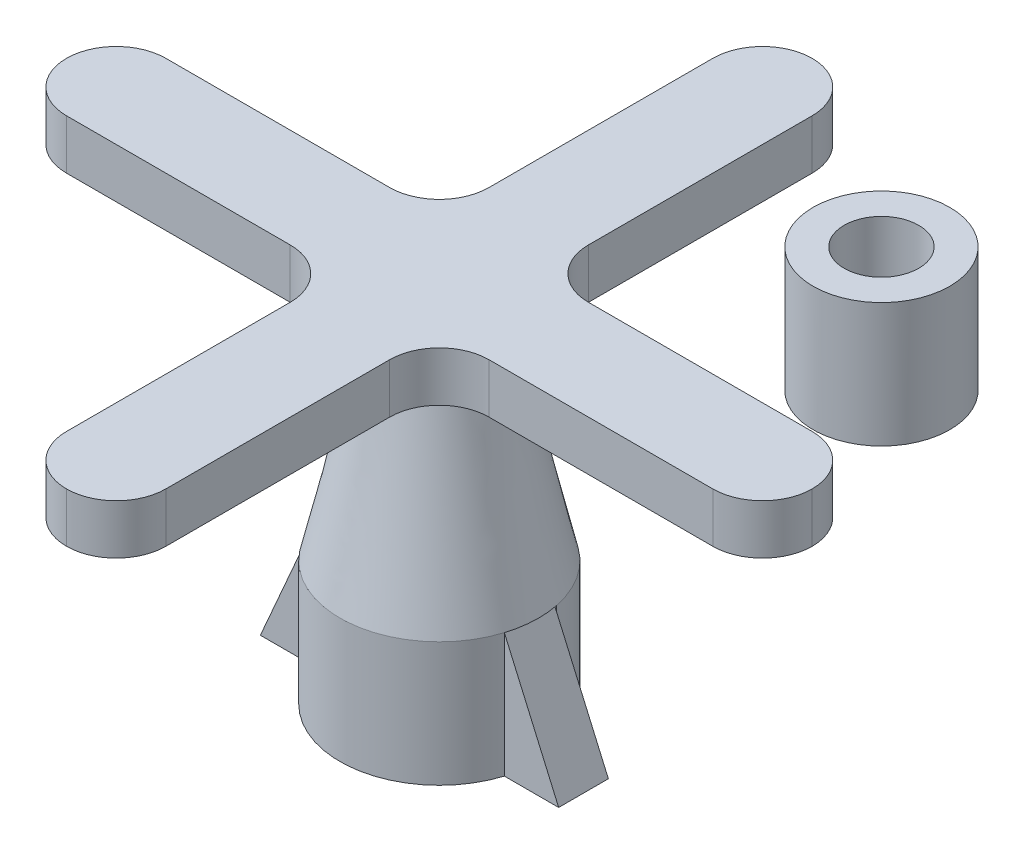
ISO-10303-21;
HEADER;
FILE_DESCRIPTION(('STEP AP214'),'2;1');
FILE_NAME('part.step','',(''),(''),'','','');
FILE_SCHEMA(('AUTOMOTIVE_DESIGN { 1 0 10303 214 1 1 1 1 }'));
ENDSEC;
DATA;
#1=APPLICATION_CONTEXT('core data for automotive mechanical design processes');
#2=APPLICATION_PROTOCOL_DEFINITION('international standard','automotive_design',2000,#1);
#3=PRODUCT_CONTEXT('',#1,'mechanical');
#4=PRODUCT('Part','Part','',(#3));
#5=PRODUCT_RELATED_PRODUCT_CATEGORY('part','',(#4));
#6=PRODUCT_DEFINITION_FORMATION('','',#4);
#7=PRODUCT_DEFINITION_CONTEXT('part definition',#1,'design');
#8=PRODUCT_DEFINITION('design','',#6,#7);
#9=PRODUCT_DEFINITION_SHAPE('','',#8);
#10=(LENGTH_UNIT() NAMED_UNIT(*) SI_UNIT(.MILLI.,.METRE.));
#11=(NAMED_UNIT(*) PLANE_ANGLE_UNIT() SI_UNIT($,.RADIAN.));
#12=(NAMED_UNIT(*) SI_UNIT($,.STERADIAN.) SOLID_ANGLE_UNIT());
#13=UNCERTAINTY_MEASURE_WITH_UNIT(LENGTH_MEASURE(1.E-05),#10,'distance_accuracy_value','');
#14=(GEOMETRIC_REPRESENTATION_CONTEXT(3) GLOBAL_UNCERTAINTY_ASSIGNED_CONTEXT((#13)) GLOBAL_UNIT_ASSIGNED_CONTEXT((#10,
#11,#12)) REPRESENTATION_CONTEXT('',''));
#15=CARTESIAN_POINT('',(0.,0.,0.));
#16=DIRECTION('',(0.,0.,1.));
#17=DIRECTION('',(1.,0.,0.));
#18=AXIS2_PLACEMENT_3D('',#15,#16,#17);
#19=CARTESIAN_POINT('',(3.5279812011762,0.,1.88503279657075));
#20=CARTESIAN_POINT('',(1.98531269592162,10.,-0.241936974049907));
#21=CARTESIAN_POINT('',(7.2980467943177,0.,-5.17092960578165));
#22=CARTESIAN_POINT('',(1.50143874782181,10.,-4.21256236589315));
#23=CARTESIAN_POINT('',(0.242084391965302,0.,-8.94099519892315));
#24=CARTESIAN_POINT('',(-2.46918664402143,10.,-3.72868841779334));
#25=CARTESIAN_POINT('',(-3.5279812011762,0.,-1.88503279657075));
#26=CARTESIAN_POINT('',(-1.98531269592162,10.,0.241936974049907));
#27=CARTESIAN_POINT('',(-7.2980467943177,0.,5.17092960578165));
#28=CARTESIAN_POINT('',(-1.50143874782181,10.,4.21256236589315));
#29=CARTESIAN_POINT('',(-0.242084391965299,0.,8.94099519892315));
#30=CARTESIAN_POINT('',(2.46918664402143,10.,3.72868841779333));
#31=CARTESIAN_POINT('',(3.5279812011762,0.,1.88503279657075));
#32=CARTESIAN_POINT('',(1.98531269592162,10.,-0.241936974049907));
#33=(BOUNDED_SURFACE() B_SPLINE_SURFACE(3,1,((#19,#20),(#21,#22),(#23,#24),(#25,#26),(#27,#28),
(#29,#30),(#31,#32)),.UNSPECIFIED.,.T.,.F.,.F.) B_SPLINE_SURFACE_WITH_KNOTS((4,3,4),(2,2),(0.,
0.5,1.),(0.,1.),.UNSPECIFIED.) GEOMETRIC_REPRESENTATION_ITEM() RATIONAL_B_SPLINE_SURFACE(((1.,
1.),(0.333333333333333,0.333333333333333),(0.333333333333333,0.333333333333333),(1.,1.),
(0.333333333333333,0.333333333333333),(0.333333333333333,0.333333333333333),(1.,1.))) REPRESENTATION_ITEM('') SURFACE());
#34=CARTESIAN_POINT('',(0.,0.,0.));
#35=DIRECTION('',(0.,-1.,0.));
#36=DIRECTION('',(0.,0.,-1.));
#37=AXIS2_PLACEMENT_3D('',#34,#35,#36);
#38=CIRCLE('',#37,4.);
#39=CARTESIAN_POINT('',(3.91905509174876,0.,-0.800629244930588));
#40=VERTEX_POINT('',#39);
#41=CARTESIAN_POINT('',(3.81595463703176,0.,1.19937075506941));
#42=VERTEX_POINT('',#41);
#43=EDGE_CURVE('E306',#40,#42,#38,.T.);
#44=CARTESIAN_POINT('',(-3.91905509174876,0.,-0.800629244930588));
#45=VERTEX_POINT('',#44);
#46=EDGE_CURVE('E284',#45,#40,#38,.T.);
#47=CARTESIAN_POINT('',(0.,0.,0.));
#48=DIRECTION('',(0.,1.,0.));
#49=DIRECTION('',(0.,0.,1.));
#50=AXIS2_PLACEMENT_3D('',#47,#48,#49);
#51=CIRCLE('',#50,4.);
#52=CARTESIAN_POINT('',(-3.81595463703176,0.,1.19937075506941));
#53=VERTEX_POINT('',#52);
#54=EDGE_CURVE('E341',#45,#53,#51,.T.);
#55=EDGE_CURVE('E310',#42,#53,#38,.T.);
#56=CARTESIAN_POINT('',(0.,8.,0.));
#57=DIRECTION('',(0.,1.,0.));
#58=DIRECTION('',(0.,0.,1.));
#59=AXIS2_PLACEMENT_3D('',#56,#57,#58);
#60=CIRCLE('',#59,2.30117095332829);
#61=CARTESIAN_POINT('',(0.,8.,2.30117095332829));
#62=VERTEX_POINT('',#61);
#63=EDGE_CURVE('E343',#62,#62,#60,.F.);
#64=ORIENTED_EDGE('',*,*,#43,.F.);
#65=ORIENTED_EDGE('',*,*,#46,.F.);
#66=ORIENTED_EDGE('',*,*,#54,.T.);
#67=ORIENTED_EDGE('',*,*,#55,.F.);
#68=EDGE_LOOP('',(#64,#65,#66,#67));
#69=FACE_BOUND('',#68,.T.);
#70=ORIENTED_EDGE('',*,*,#63,.T.);
#71=EDGE_LOOP('',(#70));
#72=FACE_BOUND('',#71,.T.);
#73=ADVANCED_FACE('F76',(#69,#72),#33,.T.);
#74=CARTESIAN_POINT('',(-2.55,0.,1.19937075506941));
#75=DIRECTION('',(0.,0.,1.));
#76=DIRECTION('',(1.,0.,0.));
#77=AXIS2_PLACEMENT_3D('',#74,#75,#76);
#78=PLANE('',#77);
#79=DIRECTION('',(0.,1.,0.));
#80=VECTOR('',#79,1.);
#81=CARTESIAN_POINT('',(-3.81595463703176,-5.,1.19937075506941));
#82=LINE('',#81,#80);
#83=CARTESIAN_POINT('',(-3.81595463703176,-5.,1.19937075506941));
#84=VERTEX_POINT('',#83);
#85=EDGE_CURVE('E313',#53,#84,#82,.F.);
#86=ORIENTED_EDGE('',*,*,#85,.F.);
#87=DIRECTION('',(0.400287328422539,0.916389684961778,0.));
#88=VECTOR('',#87,1.);
#89=CARTESIAN_POINT('',(-6.,-5.,1.19937075506941));
#90=LINE('',#89,#88);
#91=CARTESIAN_POINT('',(-6.,-5.,1.19937075506941));
#92=VERTEX_POINT('',#91);
#93=EDGE_CURVE('E322',#92,#53,#90,.T.);
#94=ORIENTED_EDGE('',*,*,#93,.F.);
#95=DIRECTION('',(-1.,0.,0.));
#96=VECTOR('',#95,1.);
#97=CARTESIAN_POINT('',(-2.55,-5.,1.19937075506941));
#98=LINE('',#97,#96);
#99=EDGE_CURVE('E418',#84,#92,#98,.T.);
#100=ORIENTED_EDGE('',*,*,#99,.F.);
#101=EDGE_LOOP('',(#86,#94,#100));
#102=FACE_BOUND('',#101,.T.);
#103=ADVANCED_FACE('F521',(#102),#78,.T.);
#104=CARTESIAN_POINT('',(2.55,0.,1.19937075506941));
#105=DIRECTION('',(0.,0.,1.));
#106=DIRECTION('',(1.,0.,0.));
#107=AXIS2_PLACEMENT_3D('',#104,#105,#106);
#108=PLANE('',#107);
#109=DIRECTION('',(-1.,0.,0.));
#110=VECTOR('',#109,1.);
#111=CARTESIAN_POINT('',(2.55,-5.,1.19937075506941));
#112=LINE('',#111,#110);
#113=CARTESIAN_POINT('',(6.,-5.,1.19937075506941));
#114=VERTEX_POINT('',#113);
#115=CARTESIAN_POINT('',(3.81595463703177,-5.,1.19937075506941));
#116=VERTEX_POINT('',#115);
#117=EDGE_CURVE('E314',#114,#116,#112,.T.);
#118=ORIENTED_EDGE('',*,*,#117,.F.);
#119=DIRECTION('',(0.400287328422539,-0.916389684961778,0.));
#120=VECTOR('',#119,1.);
#121=CARTESIAN_POINT('',(3.81595463703176,0.,1.19937075506941));
#122=LINE('',#121,#120);
#123=EDGE_CURVE('E323',#42,#114,#122,.T.);
#124=ORIENTED_EDGE('',*,*,#123,.F.);
#125=DIRECTION('',(0.,1.,0.));
#126=VECTOR('',#125,1.);
#127=CARTESIAN_POINT('',(3.81595463703176,-5.,1.19937075506941));
#128=LINE('',#127,#126);
#129=EDGE_CURVE('E354',#116,#42,#128,.T.);
#130=ORIENTED_EDGE('',*,*,#129,.F.);
#131=EDGE_LOOP('',(#118,#124,#130));
#132=FACE_BOUND('',#131,.T.);
#133=ADVANCED_FACE('F397',(#132),#108,.T.);
#134=CARTESIAN_POINT('',(0.,-5.,0.));
#135=DIRECTION('',(0.,1.,0.));
#136=DIRECTION('',(0.,0.,1.));
#137=AXIS2_PLACEMENT_3D('',#134,#135,#136);
#138=CYLINDRICAL_SURFACE('',#137,4.);
#139=CARTESIAN_POINT('',(0.,-5.,0.));
#140=DIRECTION('',(0.,-1.,0.));
#141=DIRECTION('',(0.,0.,-1.));
#142=AXIS2_PLACEMENT_3D('',#139,#140,#141);
#143=CIRCLE('',#142,4.);
#144=CARTESIAN_POINT('',(-3.91905509174876,-5.,-0.800629244930589));
#145=VERTEX_POINT('',#144);
#146=CARTESIAN_POINT('',(3.91905509174876,-5.,-0.800629244930588));
#147=VERTEX_POINT('',#146);
#148=EDGE_CURVE('E419',#145,#147,#143,.T.);
#149=ORIENTED_EDGE('',*,*,#148,.F.);
#150=DIRECTION('',(0.,1.,0.));
#151=VECTOR('',#150,1.);
#152=CARTESIAN_POINT('',(-3.91905509174876,-5.,-0.800629244930588));
#153=LINE('',#152,#151);
#154=CARTESIAN_POINT('',(-3.91905509174876,-0.236030937051775,-0.800629244930588));
#155=VERTEX_POINT('',#154);
#156=EDGE_CURVE('E346',#145,#155,#153,.T.);
#157=ORIENTED_EDGE('',*,*,#156,.T.);
#158=EDGE_CURVE('E289',#155,#45,#153,.T.);
#159=ORIENTED_EDGE('',*,*,#158,.T.);
#160=ORIENTED_EDGE('',*,*,#46,.T.);
#161=DIRECTION('',(0.,1.,0.));
#162=VECTOR('',#161,1.);
#163=CARTESIAN_POINT('',(3.91905509174876,-5.,-0.800629244930588));
#164=LINE('',#163,#162);
#165=CARTESIAN_POINT('',(3.91905509174876,-0.236030937051775,-0.800629244930588));
#166=VERTEX_POINT('',#165);
#167=EDGE_CURVE('E288',#40,#166,#164,.F.);
#168=ORIENTED_EDGE('',*,*,#167,.T.);
#169=EDGE_CURVE('E315',#166,#147,#164,.F.);
#170=ORIENTED_EDGE('',*,*,#169,.T.);
#171=EDGE_LOOP('',(#149,#157,#159,#160,#168,#170));
#172=FACE_BOUND('',#171,.T.);
#173=ADVANCED_FACE('F364',(#172),#138,.T.);
#174=CARTESIAN_POINT('',(0.,-5.,0.));
#175=DIRECTION('',(0.,-1.,0.));
#176=DIRECTION('',(0.,0.,-1.));
#177=AXIS2_PLACEMENT_3D('',#174,#175,#176);
#178=PLANE('',#177);
#179=CARTESIAN_POINT('',(0.,-5.,0.));
#180=DIRECTION('',(0.,-1.,0.));
#181=DIRECTION('',(0.,0.,-1.));
#182=AXIS2_PLACEMENT_3D('',#179,#180,#181);
#183=CIRCLE('',#182,2.75);
#184=CARTESIAN_POINT('',(0.,-5.,-2.75));
#185=VERTEX_POINT('',#184);
#186=EDGE_CURVE('E334',#185,#185,#183,.T.);
#187=ORIENTED_EDGE('',*,*,#186,.F.);
#188=EDGE_LOOP('',(#187));
#189=FACE_BOUND('',#188,.T.);
#190=EDGE_CURVE('E405',#116,#84,#143,.T.);
#191=ORIENTED_EDGE('',*,*,#190,.T.);
#192=ORIENTED_EDGE('',*,*,#99,.T.);
#193=DIRECTION('',(0.,0.,-1.));
#194=VECTOR('',#193,1.);
#195=CARTESIAN_POINT('',(-6.,-5.,-0.800629244930588));
#196=LINE('',#195,#194);
#197=CARTESIAN_POINT('',(-6.,-5.,-0.800629244930588));
#198=VERTEX_POINT('',#197);
#199=EDGE_CURVE('E423',#92,#198,#196,.T.);
#200=ORIENTED_EDGE('',*,*,#199,.T.);
#201=DIRECTION('',(1.,0.,0.));
#202=VECTOR('',#201,1.);
#203=CARTESIAN_POINT('',(-2.55,-5.,-0.800629244930588));
#204=LINE('',#203,#202);
#205=EDGE_CURVE('E427',#198,#145,#204,.T.);
#206=ORIENTED_EDGE('',*,*,#205,.T.);
#207=ORIENTED_EDGE('',*,*,#148,.T.);
#208=DIRECTION('',(1.,0.,0.));
#209=VECTOR('',#208,1.);
#210=CARTESIAN_POINT('',(2.55,-5.,-0.800629244930588));
#211=LINE('',#210,#209);
#212=CARTESIAN_POINT('',(6.,-5.,-0.800629244930588));
#213=VERTEX_POINT('',#212);
#214=EDGE_CURVE('E426',#147,#213,#211,.T.);
#215=ORIENTED_EDGE('',*,*,#214,.T.);
#216=DIRECTION('',(0.,0.,1.));
#217=VECTOR('',#216,1.);
#218=CARTESIAN_POINT('',(6.,-5.,1.19937075506941));
#219=LINE('',#218,#217);
#220=EDGE_CURVE('E431',#213,#114,#219,.T.);
#221=ORIENTED_EDGE('',*,*,#220,.T.);
#222=ORIENTED_EDGE('',*,*,#117,.T.);
#223=EDGE_LOOP('',(#191,#192,#200,#206,#207,#215,#221,#222));
#224=FACE_BOUND('',#223,.T.);
#225=ADVANCED_FACE('F539',(#189,#224),#178,.T.);
#226=ORIENTED_EDGE('',*,*,#55,.T.);
#227=ORIENTED_EDGE('',*,*,#85,.T.);
#228=ORIENTED_EDGE('',*,*,#190,.F.);
#229=ORIENTED_EDGE('',*,*,#129,.T.);
#230=EDGE_LOOP('',(#226,#227,#228,#229));
#231=FACE_BOUND('',#230,.T.);
#232=ADVANCED_FACE('F402',(#231),#138,.T.);
#233=CARTESIAN_POINT('',(2.55,0.,-0.800629244930588));
#234=DIRECTION('',(0.,0.,-1.));
#235=DIRECTION('',(-1.,0.,0.));
#236=AXIS2_PLACEMENT_3D('',#233,#234,#235);
#237=PLANE('',#236);
#238=DIRECTION('',(0.400287328422539,-0.916389684961778,0.));
#239=VECTOR('',#238,1.);
#240=CARTESIAN_POINT('',(6.,-5.,-0.800629244930588));
#241=LINE('',#240,#239);
#242=EDGE_CURVE('E406',#166,#213,#241,.T.);
#243=ORIENTED_EDGE('',*,*,#242,.T.);
#244=ORIENTED_EDGE('',*,*,#214,.F.);
#245=ORIENTED_EDGE('',*,*,#169,.F.);
#246=EDGE_LOOP('',(#243,#244,#245));
#247=FACE_BOUND('',#246,.T.);
#248=ADVANCED_FACE('F538',(#247),#237,.T.);
#249=CARTESIAN_POINT('',(-2.55,0.,-0.800629244930588));
#250=DIRECTION('',(0.,0.,-1.));
#251=DIRECTION('',(-1.,0.,0.));
#252=AXIS2_PLACEMENT_3D('',#249,#250,#251);
#253=PLANE('',#252);
#254=DIRECTION('',(0.400287328422539,0.916389684961778,0.));
#255=VECTOR('',#254,1.);
#256=CARTESIAN_POINT('',(-3.81595463703176,0.,-0.800629244930588));
#257=LINE('',#256,#255);
#258=EDGE_CURVE('E409',#198,#155,#257,.T.);
#259=ORIENTED_EDGE('',*,*,#258,.T.);
#260=ORIENTED_EDGE('',*,*,#156,.F.);
#261=ORIENTED_EDGE('',*,*,#205,.F.);
#262=EDGE_LOOP('',(#259,#260,#261));
#263=FACE_BOUND('',#262,.T.);
#264=ADVANCED_FACE('F547',(#263),#253,.T.);
#265=CARTESIAN_POINT('',(0.,0.,0.));
#266=DIRECTION('',(0.,-1.,0.));
#267=DIRECTION('',(0.,0.,-1.));
#268=AXIS2_PLACEMENT_3D('',#265,#266,#267);
#269=CYLINDRICAL_SURFACE('',#268,2.75);
#270=CARTESIAN_POINT('',(0.,0.,0.));
#271=DIRECTION('',(0.,1.,0.));
#272=DIRECTION('',(0.,0.,1.));
#273=AXIS2_PLACEMENT_3D('',#270,#271,#272);
#274=CIRCLE('',#273,2.75);
#275=CARTESIAN_POINT('',(0.,0.,2.75));
#276=VERTEX_POINT('',#275);
#277=EDGE_CURVE('E442',#276,#276,#274,.T.);
#278=ORIENTED_EDGE('',*,*,#277,.T.);
#279=EDGE_LOOP('',(#278));
#280=FACE_BOUND('',#279,.T.);
#281=ORIENTED_EDGE('',*,*,#186,.T.);
#282=EDGE_LOOP('',(#281));
#283=FACE_BOUND('',#282,.T.);
#284=ADVANCED_FACE('F458',(#280,#283),#269,.F.);
#285=CARTESIAN_POINT('',(2.75,0.,0.));
#286=CARTESIAN_POINT('',(2.61984920581438,1.77145222827966,0.));
#287=CARTESIAN_POINT('',(0.,1.6,0.));
#288=B_SPLINE_CURVE_WITH_KNOTS('',2,(#285,#286,#287),.UNSPECIFIED.,.F.,.F.,(3,3),(0.,1.),.UNSPECIFIED.);
#289=CARTESIAN_POINT('',(0.,0.,0.));
#290=DIRECTION('',(0.,1.,0.));
#291=AXIS1_PLACEMENT('',#289,#290);
#292=SURFACE_OF_REVOLUTION('',#288,#291);
#293=CARTESIAN_POINT('',(0.,1.6,0.));
#294=VERTEX_POINT('',#293);
#295=VERTEX_LOOP('',#294);
#296=FACE_BOUND('',#295,.T.);
#297=ORIENTED_EDGE('',*,*,#277,.F.);
#298=EDGE_LOOP('',(#297));
#299=FACE_BOUND('',#298,.T.);
#300=ADVANCED_FACE('F454',(#296,#299),#292,.F.);
#301=CARTESIAN_POINT('',(6.,0.,1.19937075506941));
#302=DIRECTION('',(0.,-1.,0.));
#303=DIRECTION('',(0.,0.,-1.));
#304=AXIS2_PLACEMENT_3D('',#301,#302,#303);
#305=PLANE('',#304);
#306=DIRECTION('',(0.,0.,-1.));
#307=VECTOR('',#306,1.);
#308=CARTESIAN_POINT('',(3.81595463703176,0.,1.19937075506941));
#309=LINE('',#308,#307);
#310=CARTESIAN_POINT('',(3.81595463703176,0.,-0.800629244930588));
#311=VERTEX_POINT('',#310);
#312=EDGE_CURVE('E331',#42,#311,#309,.T.);
#313=ORIENTED_EDGE('',*,*,#312,.T.);
#314=DIRECTION('',(-1.,0.,0.));
#315=VECTOR('',#314,1.);
#316=CARTESIAN_POINT('',(3.81595463703176,0.,-0.800629244930588));
#317=LINE('',#316,#315);
#318=EDGE_CURVE('E328',#40,#311,#317,.T.);
#319=ORIENTED_EDGE('',*,*,#318,.F.);
#320=ORIENTED_EDGE('',*,*,#43,.T.);
#321=EDGE_LOOP('',(#313,#319,#320));
#322=FACE_BOUND('',#321,.T.);
#323=ADVANCED_FACE('F379',(#322),#305,.T.);
#324=CARTESIAN_POINT('',(3.81595463703176,0.,1.19937075506941));
#325=DIRECTION('',(0.916389684961778,0.400287328422539,0.));
#326=DIRECTION('',(-0.400287328422539,0.916389684961778,0.));
#327=AXIS2_PLACEMENT_3D('',#324,#325,#326);
#328=PLANE('',#327);
#329=ORIENTED_EDGE('',*,*,#123,.T.);
#330=ORIENTED_EDGE('',*,*,#220,.F.);
#331=ORIENTED_EDGE('',*,*,#242,.F.);
#332=EDGE_CURVE('E393',#311,#166,#241,.T.);
#333=ORIENTED_EDGE('',*,*,#332,.F.);
#334=ORIENTED_EDGE('',*,*,#312,.F.);
#335=EDGE_LOOP('',(#329,#330,#331,#333,#334));
#336=FACE_BOUND('',#335,.T.);
#337=ADVANCED_FACE('F387',(#336),#328,.T.);
#338=CARTESIAN_POINT('',(-6.,-5.,1.19937075506941));
#339=DIRECTION('',(-0.916389684961778,0.400287328422539,0.));
#340=DIRECTION('',(-0.400287328422539,-0.916389684961778,0.));
#341=AXIS2_PLACEMENT_3D('',#338,#339,#340);
#342=PLANE('',#341);
#343=DIRECTION('',(0.,0.,-1.));
#344=VECTOR('',#343,1.);
#345=CARTESIAN_POINT('',(-3.81595463703176,0.,1.19937075506941));
#346=LINE('',#345,#344);
#347=CARTESIAN_POINT('',(-3.81595463703176,0.,-0.800629244930588));
#348=VERTEX_POINT('',#347);
#349=EDGE_CURVE('E319',#53,#348,#346,.T.);
#350=ORIENTED_EDGE('',*,*,#349,.T.);
#351=EDGE_CURVE('E563',#155,#348,#257,.T.);
#352=ORIENTED_EDGE('',*,*,#351,.F.);
#353=ORIENTED_EDGE('',*,*,#258,.F.);
#354=ORIENTED_EDGE('',*,*,#199,.F.);
#355=ORIENTED_EDGE('',*,*,#93,.T.);
#356=EDGE_LOOP('',(#350,#352,#353,#354,#355));
#357=FACE_BOUND('',#356,.T.);
#358=ADVANCED_FACE('F475',(#357),#342,.T.);
#359=CARTESIAN_POINT('',(-3.81595463703176,0.,1.19937075506941));
#360=DIRECTION('',(0.,-1.,0.));
#361=DIRECTION('',(0.,0.,-1.));
#362=AXIS2_PLACEMENT_3D('',#359,#360,#361);
#363=PLANE('',#362);
#364=ORIENTED_EDGE('',*,*,#349,.F.);
#365=ORIENTED_EDGE('',*,*,#54,.F.);
#366=DIRECTION('',(-1.,0.,0.));
#367=VECTOR('',#366,1.);
#368=CARTESIAN_POINT('',(-6.,0.,-0.800629244930588));
#369=LINE('',#368,#367);
#370=EDGE_CURVE('E197',#348,#45,#369,.T.);
#371=ORIENTED_EDGE('',*,*,#370,.F.);
#372=EDGE_LOOP('',(#364,#365,#371));
#373=FACE_BOUND('',#372,.T.);
#374=ADVANCED_FACE('F478',(#373),#363,.T.);
#375=CARTESIAN_POINT('',(0.,0.,-0.800629244930588));
#376=DIRECTION('',(0.,0.,-1.));
#377=DIRECTION('',(-1.,0.,0.));
#378=AXIS2_PLACEMENT_3D('',#375,#376,#377);
#379=PLANE('',#378);
#380=ORIENTED_EDGE('',*,*,#318,.T.);
#381=ORIENTED_EDGE('',*,*,#332,.T.);
#382=ORIENTED_EDGE('',*,*,#167,.F.);
#383=EDGE_LOOP('',(#380,#381,#382));
#384=FACE_BOUND('',#383,.T.);
#385=ADVANCED_FACE('F482',(#384),#379,.F.);
#386=CARTESIAN_POINT('',(0.,0.,-0.800629244930588));
#387=DIRECTION('',(0.,0.,1.));
#388=DIRECTION('',(1.,0.,0.));
#389=AXIS2_PLACEMENT_3D('',#386,#387,#388);
#390=PLANE('',#389);
#391=ORIENTED_EDGE('',*,*,#158,.F.);
#392=ORIENTED_EDGE('',*,*,#351,.T.);
#393=ORIENTED_EDGE('',*,*,#370,.T.);
#394=EDGE_LOOP('',(#391,#392,#393));
#395=FACE_BOUND('',#394,.T.);
#396=ADVANCED_FACE('F486',(#395),#390,.T.);
#397=CARTESIAN_POINT('',(-2.,8.,-15.));
#398=DIRECTION('',(-1.,0.,0.));
#399=DIRECTION('',(0.,0.,1.));
#400=AXIS2_PLACEMENT_3D('',#397,#398,#399);
#401=PLANE('',#400);
#402=DIRECTION('',(0.,0.,1.));
#403=VECTOR('',#402,1.);
#404=CARTESIAN_POINT('',(-2.,10.,-15.));
#405=LINE('',#404,#403);
#406=CARTESIAN_POINT('',(-2.,10.,-13.));
#407=VERTEX_POINT('',#406);
#408=CARTESIAN_POINT('',(-2.,10.,-4.));
#409=VERTEX_POINT('',#408);
#410=EDGE_CURVE('E13',#407,#409,#405,.T.);
#411=ORIENTED_EDGE('',*,*,#410,.F.);
#412=DIRECTION('',(0.,1.,0.));
#413=VECTOR('',#412,1.);
#414=CARTESIAN_POINT('',(-2.,8.,-13.));
#415=LINE('',#414,#413);
#416=CARTESIAN_POINT('',(-2.,8.,-13.));
#417=VERTEX_POINT('',#416);
#418=EDGE_CURVE('E193',#407,#417,#415,.F.);
#419=ORIENTED_EDGE('',*,*,#418,.T.);
#420=DIRECTION('',(0.,0.,1.));
#421=VECTOR('',#420,1.);
#422=CARTESIAN_POINT('',(-2.,8.,-15.));
#423=LINE('',#422,#421);
#424=CARTESIAN_POINT('',(-2.,8.,-4.));
#425=VERTEX_POINT('',#424);
#426=EDGE_CURVE('E196',#417,#425,#423,.T.);
#427=ORIENTED_EDGE('',*,*,#426,.T.);
#428=DIRECTION('',(0.,-1.,0.));
#429=VECTOR('',#428,1.);
#430=CARTESIAN_POINT('',(-2.,10.,-4.));
#431=LINE('',#430,#429);
#432=EDGE_CURVE('E265',#425,#409,#431,.F.);
#433=ORIENTED_EDGE('',*,*,#432,.T.);
#434=EDGE_LOOP('',(#411,#419,#427,#433));
#435=FACE_BOUND('',#434,.T.);
#436=ADVANCED_FACE('F490',(#435),#401,.T.);
#437=CARTESIAN_POINT('',(2.,8.,-15.));
#438=DIRECTION('',(1.,0.,0.));
#439=DIRECTION('',(0.,0.,-1.));
#440=AXIS2_PLACEMENT_3D('',#437,#438,#439);
#441=PLANE('',#440);
#442=DIRECTION('',(0.,0.,-1.));
#443=VECTOR('',#442,1.);
#444=CARTESIAN_POINT('',(2.,8.,-15.));
#445=LINE('',#444,#443);
#446=CARTESIAN_POINT('',(2.,8.,-4.));
#447=VERTEX_POINT('',#446);
#448=CARTESIAN_POINT('',(2.,8.,-13.));
#449=VERTEX_POINT('',#448);
#450=EDGE_CURVE('E246',#447,#449,#445,.T.);
#451=ORIENTED_EDGE('',*,*,#450,.T.);
#452=DIRECTION('',(0.,1.,0.));
#453=VECTOR('',#452,1.);
#454=CARTESIAN_POINT('',(2.,8.,-13.));
#455=LINE('',#454,#453);
#456=CARTESIAN_POINT('',(2.,10.,-13.));
#457=VERTEX_POINT('',#456);
#458=EDGE_CURVE('E243',#449,#457,#455,.T.);
#459=ORIENTED_EDGE('',*,*,#458,.T.);
#460=DIRECTION('',(0.,0.,-1.));
#461=VECTOR('',#460,1.);
#462=CARTESIAN_POINT('',(2.,10.,-15.));
#463=LINE('',#462,#461);
#464=CARTESIAN_POINT('',(2.,10.,-4.));
#465=VERTEX_POINT('',#464);
#466=EDGE_CURVE('E227',#465,#457,#463,.T.);
#467=ORIENTED_EDGE('',*,*,#466,.F.);
#468=DIRECTION('',(0.,1.,0.));
#469=VECTOR('',#468,1.);
#470=CARTESIAN_POINT('',(2.,8.,-4.));
#471=LINE('',#470,#469);
#472=EDGE_CURVE('E177',#465,#447,#471,.F.);
#473=ORIENTED_EDGE('',*,*,#472,.T.);
#474=EDGE_LOOP('',(#451,#459,#467,#473));
#475=FACE_BOUND('',#474,.T.);
#476=ADVANCED_FACE('F492',(#475),#441,.T.);
#477=CARTESIAN_POINT('',(2.,10.,13.));
#478=VERTEX_POINT('',#477);
#479=CARTESIAN_POINT('',(2.,10.,4.));
#480=VERTEX_POINT('',#479);
#481=EDGE_CURVE('E241',#478,#480,#463,.T.);
#482=ORIENTED_EDGE('',*,*,#481,.F.);
#483=DIRECTION('',(0.,1.,0.));
#484=VECTOR('',#483,1.);
#485=CARTESIAN_POINT('',(2.,8.,13.));
#486=LINE('',#485,#484);
#487=CARTESIAN_POINT('',(2.,8.,13.));
#488=VERTEX_POINT('',#487);
#489=EDGE_CURVE('E173',#478,#488,#486,.F.);
#490=ORIENTED_EDGE('',*,*,#489,.T.);
#491=CARTESIAN_POINT('',(2.,8.,4.));
#492=VERTEX_POINT('',#491);
#493=EDGE_CURVE('E176',#488,#492,#445,.T.);
#494=ORIENTED_EDGE('',*,*,#493,.T.);
#495=DIRECTION('',(0.,-1.,0.));
#496=VECTOR('',#495,1.);
#497=CARTESIAN_POINT('',(2.,10.,4.));
#498=LINE('',#497,#496);
#499=EDGE_CURVE('E205',#492,#480,#498,.F.);
#500=ORIENTED_EDGE('',*,*,#499,.T.);
#501=EDGE_LOOP('',(#482,#490,#494,#500));
#502=FACE_BOUND('',#501,.T.);
#503=ADVANCED_FACE('F495',(#502),#441,.T.);
#504=CARTESIAN_POINT('',(0.,8.,0.));
#505=DIRECTION('',(0.,1.,0.));
#506=DIRECTION('',(0.,0.,1.));
#507=AXIS2_PLACEMENT_3D('',#504,#505,#506);
#508=PLANE('',#507);
#509=ORIENTED_EDGE('',*,*,#63,.F.);
#510=EDGE_LOOP('',(#509));
#511=FACE_BOUND('',#510,.T.);
#512=CARTESIAN_POINT('',(0.,8.,-13.));
#513=DIRECTION('',(0.,1.,0.));
#514=DIRECTION('',(0.,0.,1.));
#515=AXIS2_PLACEMENT_3D('',#512,#513,#514);
#516=CIRCLE('',#515,2.);
#517=CARTESIAN_POINT('',(0.,8.,-15.));
#518=VERTEX_POINT('',#517);
#519=EDGE_CURVE('E202',#417,#518,#516,.F.);
#520=ORIENTED_EDGE('',*,*,#519,.T.);
#521=CARTESIAN_POINT('',(0.,8.,-13.));
#522=DIRECTION('',(0.,1.,0.));
#523=DIRECTION('',(0.,0.,1.));
#524=AXIS2_PLACEMENT_3D('',#521,#522,#523);
#525=CIRCLE('',#524,2.);
#526=EDGE_CURVE('E198',#518,#449,#525,.F.);
#527=ORIENTED_EDGE('',*,*,#526,.T.);
#528=ORIENTED_EDGE('',*,*,#450,.F.);
#529=CARTESIAN_POINT('',(4.,8.,-4.));
#530=DIRECTION('',(0.,1.,0.));
#531=DIRECTION('',(0.,0.,1.));
#532=AXIS2_PLACEMENT_3D('',#529,#530,#531);
#533=CIRCLE('',#532,2.);
#534=CARTESIAN_POINT('',(4.,8.,-2.));
#535=VERTEX_POINT('',#534);
#536=EDGE_CURVE('E201',#447,#535,#533,.T.);
#537=ORIENTED_EDGE('',*,*,#536,.T.);
#538=DIRECTION('',(-1.,0.,0.));
#539=VECTOR('',#538,1.);
#540=CARTESIAN_POINT('',(-15.,8.,-2.));
#541=LINE('',#540,#539);
#542=CARTESIAN_POINT('',(13.,8.,-2.));
#543=VERTEX_POINT('',#542);
#544=EDGE_CURVE('E80',#543,#535,#541,.T.);
#545=ORIENTED_EDGE('',*,*,#544,.F.);
#546=CARTESIAN_POINT('',(13.,8.,0.));
#547=DIRECTION('',(0.,1.,0.));
#548=DIRECTION('',(0.,0.,1.));
#549=AXIS2_PLACEMENT_3D('',#546,#547,#548);
#550=CIRCLE('',#549,2.);
#551=CARTESIAN_POINT('',(15.,8.,0.));
#552=VERTEX_POINT('',#551);
#553=EDGE_CURVE('E222',#543,#552,#550,.F.);
#554=ORIENTED_EDGE('',*,*,#553,.T.);
#555=CARTESIAN_POINT('',(13.,8.,0.));
#556=DIRECTION('',(0.,1.,0.));
#557=DIRECTION('',(0.,0.,1.));
#558=AXIS2_PLACEMENT_3D('',#555,#556,#557);
#559=CIRCLE('',#558,2.);
#560=CARTESIAN_POINT('',(13.,8.,2.));
#561=VERTEX_POINT('',#560);
#562=EDGE_CURVE('E153',#552,#561,#559,.F.);
#563=ORIENTED_EDGE('',*,*,#562,.T.);
#564=DIRECTION('',(1.,0.,0.));
#565=VECTOR('',#564,1.);
#566=CARTESIAN_POINT('',(-15.,8.,2.));
#567=LINE('',#566,#565);
#568=CARTESIAN_POINT('',(4.,8.,2.));
#569=VERTEX_POINT('',#568);
#570=EDGE_CURVE('E172',#569,#561,#567,.T.);
#571=ORIENTED_EDGE('',*,*,#570,.F.);
#572=CARTESIAN_POINT('',(4.,8.,4.));
#573=DIRECTION('',(0.,1.,0.));
#574=DIRECTION('',(0.,0.,1.));
#575=AXIS2_PLACEMENT_3D('',#572,#573,#574);
#576=CIRCLE('',#575,2.);
#577=EDGE_CURVE('E220',#569,#492,#576,.T.);
#578=ORIENTED_EDGE('',*,*,#577,.T.);
#579=ORIENTED_EDGE('',*,*,#493,.F.);
#580=CARTESIAN_POINT('',(0.,8.,13.));
#581=DIRECTION('',(0.,1.,0.));
#582=DIRECTION('',(0.,0.,1.));
#583=AXIS2_PLACEMENT_3D('',#580,#581,#582);
#584=CIRCLE('',#583,2.);
#585=CARTESIAN_POINT('',(0.,8.,15.));
#586=VERTEX_POINT('',#585);
#587=EDGE_CURVE('E217',#488,#586,#584,.F.);
#588=ORIENTED_EDGE('',*,*,#587,.T.);
#589=CARTESIAN_POINT('',(0.,8.,13.));
#590=DIRECTION('',(0.,1.,0.));
#591=DIRECTION('',(0.,0.,1.));
#592=AXIS2_PLACEMENT_3D('',#589,#590,#591);
#593=CIRCLE('',#592,2.);
#594=CARTESIAN_POINT('',(-2.,8.,13.));
#595=VERTEX_POINT('',#594);
#596=EDGE_CURVE('E214',#586,#595,#593,.F.);
#597=ORIENTED_EDGE('',*,*,#596,.T.);
#598=CARTESIAN_POINT('',(-2.,8.,4.));
#599=VERTEX_POINT('',#598);
#600=EDGE_CURVE('E182',#599,#595,#423,.T.);
#601=ORIENTED_EDGE('',*,*,#600,.F.);
#602=CARTESIAN_POINT('',(-4.,8.,4.));
#603=DIRECTION('',(0.,1.,0.));
#604=DIRECTION('',(0.,0.,1.));
#605=AXIS2_PLACEMENT_3D('',#602,#603,#604);
#606=CIRCLE('',#605,2.);
#607=CARTESIAN_POINT('',(-4.,8.,2.));
#608=VERTEX_POINT('',#607);
#609=EDGE_CURVE('E213',#599,#608,#606,.T.);
#610=ORIENTED_EDGE('',*,*,#609,.T.);
#611=CARTESIAN_POINT('',(-13.,8.,2.));
#612=VERTEX_POINT('',#611);
#613=EDGE_CURVE('E186',#612,#608,#567,.T.);
#614=ORIENTED_EDGE('',*,*,#613,.F.);
#615=CARTESIAN_POINT('',(-13.,8.,0.));
#616=DIRECTION('',(0.,1.,0.));
#617=DIRECTION('',(0.,0.,1.));
#618=AXIS2_PLACEMENT_3D('',#615,#616,#617);
#619=CIRCLE('',#618,2.);
#620=CARTESIAN_POINT('',(-15.,8.,0.));
#621=VERTEX_POINT('',#620);
#622=EDGE_CURVE('E210',#612,#621,#619,.F.);
#623=ORIENTED_EDGE('',*,*,#622,.T.);
#624=CARTESIAN_POINT('',(-13.,8.,0.));
#625=DIRECTION('',(0.,1.,0.));
#626=DIRECTION('',(0.,0.,1.));
#627=AXIS2_PLACEMENT_3D('',#624,#625,#626);
#628=CIRCLE('',#627,2.);
#629=CARTESIAN_POINT('',(-13.,8.,-2.));
#630=VERTEX_POINT('',#629);
#631=EDGE_CURVE('E206',#621,#630,#628,.F.);
#632=ORIENTED_EDGE('',*,*,#631,.T.);
#633=CARTESIAN_POINT('',(-4.,8.,-2.));
#634=VERTEX_POINT('',#633);
#635=EDGE_CURVE('E192',#634,#630,#541,.T.);
#636=ORIENTED_EDGE('',*,*,#635,.F.);
#637=CARTESIAN_POINT('',(-4.,8.,-4.));
#638=DIRECTION('',(0.,1.,0.));
#639=DIRECTION('',(0.,0.,1.));
#640=AXIS2_PLACEMENT_3D('',#637,#638,#639);
#641=CIRCLE('',#640,2.);
#642=EDGE_CURVE('E209',#634,#425,#641,.T.);
#643=ORIENTED_EDGE('',*,*,#642,.T.);
#644=ORIENTED_EDGE('',*,*,#426,.F.);
#645=EDGE_LOOP('',(#520,#527,#528,#537,#545,#554,#563,#571,#578,#579,#588,#597,#601,#610,#614,
#623,#632,#636,#643,#644));
#646=FACE_BOUND('',#645,.T.);
#647=ADVANCED_FACE('F500',(#511,#646),#508,.F.);
#648=ORIENTED_EDGE('',*,*,#600,.T.);
#649=DIRECTION('',(0.,1.,0.));
#650=VECTOR('',#649,1.);
#651=CARTESIAN_POINT('',(-2.,8.,13.));
#652=LINE('',#651,#650);
#653=CARTESIAN_POINT('',(-2.,10.,13.));
#654=VERTEX_POINT('',#653);
#655=EDGE_CURVE('E178',#595,#654,#652,.T.);
#656=ORIENTED_EDGE('',*,*,#655,.T.);
#657=CARTESIAN_POINT('',(-2.,10.,4.));
#658=VERTEX_POINT('',#657);
#659=EDGE_CURVE('E89',#658,#654,#405,.T.);
#660=ORIENTED_EDGE('',*,*,#659,.F.);
#661=DIRECTION('',(0.,1.,0.));
#662=VECTOR('',#661,1.);
#663=CARTESIAN_POINT('',(-2.,8.,4.));
#664=LINE('',#663,#662);
#665=EDGE_CURVE('E181',#658,#599,#664,.F.);
#666=ORIENTED_EDGE('',*,*,#665,.T.);
#667=EDGE_LOOP('',(#648,#656,#660,#666));
#668=FACE_BOUND('',#667,.T.);
#669=ADVANCED_FACE('F497',(#668),#401,.T.);
#670=CARTESIAN_POINT('',(0.,10.,0.));
#671=DIRECTION('',(0.,1.,0.));
#672=DIRECTION('',(0.,0.,1.));
#673=AXIS2_PLACEMENT_3D('',#670,#671,#672);
#674=PLANE('',#673);
#675=CARTESIAN_POINT('',(4.,10.,4.));
#676=DIRECTION('',(0.,1.,0.));
#677=DIRECTION('',(0.,0.,1.));
#678=AXIS2_PLACEMENT_3D('',#675,#676,#677);
#679=CIRCLE('',#678,2.);
#680=CARTESIAN_POINT('',(4.00000000000001,10.,2.));
#681=VERTEX_POINT('',#680);
#682=EDGE_CURVE('E187',#480,#681,#679,.F.);
#683=ORIENTED_EDGE('',*,*,#682,.T.);
#684=DIRECTION('',(1.,0.,0.));
#685=VECTOR('',#684,1.);
#686=CARTESIAN_POINT('',(-15.,10.,2.));
#687=LINE('',#686,#685);
#688=CARTESIAN_POINT('',(13.,10.,2.));
#689=VERTEX_POINT('',#688);
#690=EDGE_CURVE('E127',#681,#689,#687,.T.);
#691=ORIENTED_EDGE('',*,*,#690,.T.);
#692=CARTESIAN_POINT('',(13.,10.,0.));
#693=DIRECTION('',(0.,1.,0.));
#694=DIRECTION('',(0.,0.,1.));
#695=AXIS2_PLACEMENT_3D('',#692,#693,#694);
#696=CIRCLE('',#695,2.);
#697=CARTESIAN_POINT('',(15.,10.,0.));
#698=VERTEX_POINT('',#697);
#699=EDGE_CURVE('E129',#689,#698,#696,.T.);
#700=ORIENTED_EDGE('',*,*,#699,.T.);
#701=CARTESIAN_POINT('',(13.,10.,0.));
#702=DIRECTION('',(0.,1.,0.));
#703=DIRECTION('',(0.,0.,1.));
#704=AXIS2_PLACEMENT_3D('',#701,#702,#703);
#705=CIRCLE('',#704,2.);
#706=CARTESIAN_POINT('',(13.,10.,-2.));
#707=VERTEX_POINT('',#706);
#708=EDGE_CURVE('E132',#698,#707,#705,.T.);
#709=ORIENTED_EDGE('',*,*,#708,.T.);
#710=DIRECTION('',(-1.,0.,0.));
#711=VECTOR('',#710,1.);
#712=CARTESIAN_POINT('',(-15.,10.,-2.));
#713=LINE('',#712,#711);
#714=CARTESIAN_POINT('',(4.,10.,-2.));
#715=VERTEX_POINT('',#714);
#716=EDGE_CURVE('E149',#707,#715,#713,.T.);
#717=ORIENTED_EDGE('',*,*,#716,.T.);
#718=CARTESIAN_POINT('',(4.,10.,-4.));
#719=DIRECTION('',(0.,1.,0.));
#720=DIRECTION('',(0.,0.,1.));
#721=AXIS2_PLACEMENT_3D('',#718,#719,#720);
#722=CIRCLE('',#721,2.);
#723=EDGE_CURVE('E249',#715,#465,#722,.F.);
#724=ORIENTED_EDGE('',*,*,#723,.T.);
#725=ORIENTED_EDGE('',*,*,#466,.T.);
#726=CARTESIAN_POINT('',(0.,10.,-13.));
#727=DIRECTION('',(0.,1.,0.));
#728=DIRECTION('',(0.,0.,1.));
#729=AXIS2_PLACEMENT_3D('',#726,#727,#728);
#730=CIRCLE('',#729,2.);
#731=CARTESIAN_POINT('',(0.,10.,-15.));
#732=VERTEX_POINT('',#731);
#733=EDGE_CURVE('E225',#457,#732,#730,.T.);
#734=ORIENTED_EDGE('',*,*,#733,.T.);
#735=CARTESIAN_POINT('',(0.,10.,-13.));
#736=DIRECTION('',(0.,1.,0.));
#737=DIRECTION('',(0.,0.,1.));
#738=AXIS2_PLACEMENT_3D('',#735,#736,#737);
#739=CIRCLE('',#738,2.);
#740=EDGE_CURVE('E87',#732,#407,#739,.T.);
#741=ORIENTED_EDGE('',*,*,#740,.T.);
#742=ORIENTED_EDGE('',*,*,#410,.T.);
#743=CARTESIAN_POINT('',(-4.,10.,-4.));
#744=DIRECTION('',(0.,1.,0.));
#745=DIRECTION('',(0.,0.,1.));
#746=AXIS2_PLACEMENT_3D('',#743,#744,#745);
#747=CIRCLE('',#746,2.);
#748=CARTESIAN_POINT('',(-4.,10.,-2.));
#749=VERTEX_POINT('',#748);
#750=EDGE_CURVE('E97',#409,#749,#747,.F.);
#751=ORIENTED_EDGE('',*,*,#750,.T.);
#752=CARTESIAN_POINT('',(-13.,10.,-2.));
#753=VERTEX_POINT('',#752);
#754=EDGE_CURVE('E233',#749,#753,#713,.T.);
#755=ORIENTED_EDGE('',*,*,#754,.T.);
#756=CARTESIAN_POINT('',(-13.,10.,0.));
#757=DIRECTION('',(0.,1.,0.));
#758=DIRECTION('',(0.,0.,1.));
#759=AXIS2_PLACEMENT_3D('',#756,#757,#758);
#760=CIRCLE('',#759,2.);
#761=CARTESIAN_POINT('',(-15.,10.,0.));
#762=VERTEX_POINT('',#761);
#763=EDGE_CURVE('E229',#753,#762,#760,.T.);
#764=ORIENTED_EDGE('',*,*,#763,.T.);
#765=CARTESIAN_POINT('',(-13.,10.,0.));
#766=DIRECTION('',(0.,1.,0.));
#767=DIRECTION('',(0.,0.,1.));
#768=AXIS2_PLACEMENT_3D('',#765,#766,#767);
#769=CIRCLE('',#768,2.);
#770=CARTESIAN_POINT('',(-13.,10.,2.));
#771=VERTEX_POINT('',#770);
#772=EDGE_CURVE('E232',#762,#771,#769,.T.);
#773=ORIENTED_EDGE('',*,*,#772,.T.);
#774=CARTESIAN_POINT('',(-4.,10.,2.));
#775=VERTEX_POINT('',#774);
#776=EDGE_CURVE('E157',#771,#775,#687,.T.);
#777=ORIENTED_EDGE('',*,*,#776,.T.);
#778=CARTESIAN_POINT('',(-4.,10.,4.));
#779=DIRECTION('',(0.,1.,0.));
#780=DIRECTION('',(0.,0.,1.));
#781=AXIS2_PLACEMENT_3D('',#778,#779,#780);
#782=CIRCLE('',#781,2.);
#783=EDGE_CURVE('E272',#775,#658,#782,.F.);
#784=ORIENTED_EDGE('',*,*,#783,.T.);
#785=ORIENTED_EDGE('',*,*,#659,.T.);
#786=CARTESIAN_POINT('',(0.,10.,13.));
#787=DIRECTION('',(0.,1.,0.));
#788=DIRECTION('',(0.,0.,1.));
#789=AXIS2_PLACEMENT_3D('',#786,#787,#788);
#790=CIRCLE('',#789,2.);
#791=CARTESIAN_POINT('',(0.,10.,15.));
#792=VERTEX_POINT('',#791);
#793=EDGE_CURVE('E236',#654,#792,#790,.T.);
#794=ORIENTED_EDGE('',*,*,#793,.T.);
#795=CARTESIAN_POINT('',(0.,10.,13.));
#796=DIRECTION('',(0.,1.,0.));
#797=DIRECTION('',(0.,0.,1.));
#798=AXIS2_PLACEMENT_3D('',#795,#796,#797);
#799=CIRCLE('',#798,2.);
#800=EDGE_CURVE('E239',#792,#478,#799,.T.);
#801=ORIENTED_EDGE('',*,*,#800,.T.);
#802=ORIENTED_EDGE('',*,*,#481,.T.);
#803=EDGE_LOOP('',(#683,#691,#700,#709,#717,#724,#725,#734,#741,#742,#751,#755,#764,#773,#777,
#784,#785,#794,#801,#802));
#804=FACE_BOUND('',#803,.T.);
#805=ADVANCED_FACE('F131',(#804),#674,.T.);
#806=CARTESIAN_POINT('',(-15.,8.,2.));
#807=DIRECTION('',(0.,0.,1.));
#808=DIRECTION('',(1.,0.,0.));
#809=AXIS2_PLACEMENT_3D('',#806,#807,#808);
#810=PLANE('',#809);
#811=ORIENTED_EDGE('',*,*,#776,.F.);
#812=DIRECTION('',(0.,1.,0.));
#813=VECTOR('',#812,1.);
#814=CARTESIAN_POINT('',(-13.,8.,2.));
#815=LINE('',#814,#813);
#816=EDGE_CURVE('E183',#771,#612,#815,.F.);
#817=ORIENTED_EDGE('',*,*,#816,.T.);
#818=ORIENTED_EDGE('',*,*,#613,.T.);
#819=DIRECTION('',(0.,1.,0.));
#820=VECTOR('',#819,1.);
#821=CARTESIAN_POINT('',(-4.,10.,2.));
#822=LINE('',#821,#820);
#823=EDGE_CURVE('E277',#608,#775,#822,.T.);
#824=ORIENTED_EDGE('',*,*,#823,.T.);
#825=EDGE_LOOP('',(#811,#817,#818,#824));
#826=FACE_BOUND('',#825,.T.);
#827=ADVANCED_FACE('F78',(#826),#810,.T.);
#828=CARTESIAN_POINT('',(-15.,8.,-2.));
#829=DIRECTION('',(0.,0.,-1.));
#830=DIRECTION('',(-1.,0.,0.));
#831=AXIS2_PLACEMENT_3D('',#828,#829,#830);
#832=PLANE('',#831);
#833=ORIENTED_EDGE('',*,*,#635,.T.);
#834=DIRECTION('',(0.,1.,0.));
#835=VECTOR('',#834,1.);
#836=CARTESIAN_POINT('',(-13.,8.,-2.));
#837=LINE('',#836,#835);
#838=EDGE_CURVE('E188',#630,#753,#837,.T.);
#839=ORIENTED_EDGE('',*,*,#838,.T.);
#840=ORIENTED_EDGE('',*,*,#754,.F.);
#841=DIRECTION('',(0.,-1.,0.));
#842=VECTOR('',#841,1.);
#843=CARTESIAN_POINT('',(-4.,8.,-2.));
#844=LINE('',#843,#842);
#845=EDGE_CURVE('E191',#749,#634,#844,.T.);
#846=ORIENTED_EDGE('',*,*,#845,.T.);
#847=EDGE_LOOP('',(#833,#839,#840,#846));
#848=FACE_BOUND('',#847,.T.);
#849=ADVANCED_FACE('F509',(#848),#832,.T.);
#850=ORIENTED_EDGE('',*,*,#570,.T.);
#851=DIRECTION('',(0.,1.,0.));
#852=VECTOR('',#851,1.);
#853=CARTESIAN_POINT('',(13.,8.,2.));
#854=LINE('',#853,#852);
#855=EDGE_CURVE('E170',#561,#689,#854,.T.);
#856=ORIENTED_EDGE('',*,*,#855,.T.);
#857=ORIENTED_EDGE('',*,*,#690,.F.);
#858=DIRECTION('',(0.,-1.,0.));
#859=VECTOR('',#858,1.);
#860=CARTESIAN_POINT('',(4.,8.,2.));
#861=LINE('',#860,#859);
#862=EDGE_CURVE('E169',#681,#569,#861,.T.);
#863=ORIENTED_EDGE('',*,*,#862,.T.);
#864=EDGE_LOOP('',(#850,#856,#857,#863));
#865=FACE_BOUND('',#864,.T.);
#866=ADVANCED_FACE('F507',(#865),#810,.T.);
#867=ORIENTED_EDGE('',*,*,#716,.F.);
#868=DIRECTION('',(0.,1.,0.));
#869=VECTOR('',#868,1.);
#870=CARTESIAN_POINT('',(13.,8.,-2.));
#871=LINE('',#870,#869);
#872=EDGE_CURVE('E148',#707,#543,#871,.F.);
#873=ORIENTED_EDGE('',*,*,#872,.T.);
#874=ORIENTED_EDGE('',*,*,#544,.T.);
#875=DIRECTION('',(0.,1.,0.));
#876=VECTOR('',#875,1.);
#877=CARTESIAN_POINT('',(4.,10.,-2.));
#878=LINE('',#877,#876);
#879=EDGE_CURVE('E167',#535,#715,#878,.T.);
#880=ORIENTED_EDGE('',*,*,#879,.T.);
#881=EDGE_LOOP('',(#867,#873,#874,#880));
#882=FACE_BOUND('',#881,.T.);
#883=ADVANCED_FACE('F504',(#882),#832,.T.);
#884=CARTESIAN_POINT('',(-4.,8.,4.));
#885=DIRECTION('',(0.,-1.,0.));
#886=DIRECTION('',(0.,0.,-1.));
#887=AXIS2_PLACEMENT_3D('',#884,#885,#886);
#888=CYLINDRICAL_SURFACE('',#887,2.);
#889=ORIENTED_EDGE('',*,*,#609,.F.);
#890=ORIENTED_EDGE('',*,*,#665,.F.);
#891=ORIENTED_EDGE('',*,*,#783,.F.);
#892=ORIENTED_EDGE('',*,*,#823,.F.);
#893=EDGE_LOOP('',(#889,#890,#891,#892));
#894=FACE_BOUND('',#893,.T.);
#895=ADVANCED_FACE('F506',(#894),#888,.F.);
#896=CARTESIAN_POINT('',(-4.,8.,-4.));
#897=DIRECTION('',(0.,1.,0.));
#898=DIRECTION('',(0.,0.,1.));
#899=AXIS2_PLACEMENT_3D('',#896,#897,#898);
#900=CYLINDRICAL_SURFACE('',#899,2.);
#901=ORIENTED_EDGE('',*,*,#750,.F.);
#902=ORIENTED_EDGE('',*,*,#432,.F.);
#903=ORIENTED_EDGE('',*,*,#642,.F.);
#904=ORIENTED_EDGE('',*,*,#845,.F.);
#905=EDGE_LOOP('',(#901,#902,#903,#904));
#906=FACE_BOUND('',#905,.T.);
#907=ADVANCED_FACE('F514',(#906),#900,.F.);
#908=CARTESIAN_POINT('',(4.,8.,4.));
#909=DIRECTION('',(0.,1.,0.));
#910=DIRECTION('',(0.,0.,1.));
#911=AXIS2_PLACEMENT_3D('',#908,#909,#910);
#912=CYLINDRICAL_SURFACE('',#911,2.);
#913=ORIENTED_EDGE('',*,*,#682,.F.);
#914=ORIENTED_EDGE('',*,*,#499,.F.);
#915=ORIENTED_EDGE('',*,*,#577,.F.);
#916=ORIENTED_EDGE('',*,*,#862,.F.);
#917=EDGE_LOOP('',(#913,#914,#915,#916));
#918=FACE_BOUND('',#917,.T.);
#919=ADVANCED_FACE('F735',(#918),#912,.F.);
#920=CARTESIAN_POINT('',(4.,8.,-4.));
#921=DIRECTION('',(0.,-1.,0.));
#922=DIRECTION('',(0.,0.,-1.));
#923=AXIS2_PLACEMENT_3D('',#920,#921,#922);
#924=CYLINDRICAL_SURFACE('',#923,2.);
#925=ORIENTED_EDGE('',*,*,#536,.F.);
#926=ORIENTED_EDGE('',*,*,#472,.F.);
#927=ORIENTED_EDGE('',*,*,#723,.F.);
#928=ORIENTED_EDGE('',*,*,#879,.F.);
#929=EDGE_LOOP('',(#925,#926,#927,#928));
#930=FACE_BOUND('',#929,.T.);
#931=ADVANCED_FACE('F718',(#930),#924,.F.);
#932=CARTESIAN_POINT('',(0.,8.,-13.));
#933=DIRECTION('',(0.,1.,0.));
#934=DIRECTION('',(0.,0.,1.));
#935=AXIS2_PLACEMENT_3D('',#932,#933,#934);
#936=CYLINDRICAL_SURFACE('',#935,2.);
#937=DIRECTION('',(0.,1.,0.));
#938=VECTOR('',#937,1.);
#939=CARTESIAN_POINT('',(0.,8.,-15.));
#940=LINE('',#939,#938);
#941=EDGE_CURVE('E164',#518,#732,#940,.T.);
#942=ORIENTED_EDGE('',*,*,#941,.F.);
#943=ORIENTED_EDGE('',*,*,#519,.F.);
#944=ORIENTED_EDGE('',*,*,#418,.F.);
#945=ORIENTED_EDGE('',*,*,#740,.F.);
#946=EDGE_LOOP('',(#942,#943,#944,#945));
#947=FACE_BOUND('',#946,.T.);
#948=ADVANCED_FACE('F730',(#947),#936,.T.);
#949=CARTESIAN_POINT('',(0.,8.,-13.));
#950=DIRECTION('',(0.,1.,0.));
#951=DIRECTION('',(0.,0.,1.));
#952=AXIS2_PLACEMENT_3D('',#949,#950,#951);
#953=CYLINDRICAL_SURFACE('',#952,2.);
#954=ORIENTED_EDGE('',*,*,#526,.F.);
#955=ORIENTED_EDGE('',*,*,#941,.T.);
#956=ORIENTED_EDGE('',*,*,#733,.F.);
#957=ORIENTED_EDGE('',*,*,#458,.F.);
#958=EDGE_LOOP('',(#954,#955,#956,#957));
#959=FACE_BOUND('',#958,.T.);
#960=ADVANCED_FACE('F724',(#959),#953,.T.);
#961=CARTESIAN_POINT('',(-13.,8.,0.));
#962=DIRECTION('',(0.,1.,0.));
#963=DIRECTION('',(0.,0.,1.));
#964=AXIS2_PLACEMENT_3D('',#961,#962,#963);
#965=CYLINDRICAL_SURFACE('',#964,2.);
#966=DIRECTION('',(0.,1.,0.));
#967=VECTOR('',#966,1.);
#968=CARTESIAN_POINT('',(-15.,8.,0.));
#969=LINE('',#968,#967);
#970=EDGE_CURVE('E159',#621,#762,#969,.T.);
#971=ORIENTED_EDGE('',*,*,#970,.F.);
#972=ORIENTED_EDGE('',*,*,#622,.F.);
#973=ORIENTED_EDGE('',*,*,#816,.F.);
#974=ORIENTED_EDGE('',*,*,#772,.F.);
#975=EDGE_LOOP('',(#971,#972,#973,#974));
#976=FACE_BOUND('',#975,.T.);
#977=ADVANCED_FACE('F701',(#976),#965,.T.);
#978=CARTESIAN_POINT('',(-13.,8.,0.));
#979=DIRECTION('',(0.,1.,0.));
#980=DIRECTION('',(0.,0.,1.));
#981=AXIS2_PLACEMENT_3D('',#978,#979,#980);
#982=CYLINDRICAL_SURFACE('',#981,2.);
#983=ORIENTED_EDGE('',*,*,#631,.F.);
#984=ORIENTED_EDGE('',*,*,#970,.T.);
#985=ORIENTED_EDGE('',*,*,#763,.F.);
#986=ORIENTED_EDGE('',*,*,#838,.F.);
#987=EDGE_LOOP('',(#983,#984,#985,#986));
#988=FACE_BOUND('',#987,.T.);
#989=ADVANCED_FACE('F705',(#988),#982,.T.);
#990=CARTESIAN_POINT('',(0.,8.,13.));
#991=DIRECTION('',(0.,1.,0.));
#992=DIRECTION('',(0.,0.,1.));
#993=AXIS2_PLACEMENT_3D('',#990,#991,#992);
#994=CYLINDRICAL_SURFACE('',#993,2.);
#995=DIRECTION('',(0.,1.,0.));
#996=VECTOR('',#995,1.);
#997=CARTESIAN_POINT('',(0.,8.,15.));
#998=LINE('',#997,#996);
#999=EDGE_CURVE('E154',#586,#792,#998,.T.);
#1000=ORIENTED_EDGE('',*,*,#999,.F.);
#1001=ORIENTED_EDGE('',*,*,#587,.F.);
#1002=ORIENTED_EDGE('',*,*,#489,.F.);
#1003=ORIENTED_EDGE('',*,*,#800,.F.);
#1004=EDGE_LOOP('',(#1000,#1001,#1002,#1003));
#1005=FACE_BOUND('',#1004,.T.);
#1006=ADVANCED_FACE('F688',(#1005),#994,.T.);
#1007=CARTESIAN_POINT('',(0.,8.,13.));
#1008=DIRECTION('',(0.,1.,0.));
#1009=DIRECTION('',(0.,0.,1.));
#1010=AXIS2_PLACEMENT_3D('',#1007,#1008,#1009);
#1011=CYLINDRICAL_SURFACE('',#1010,2.);
#1012=ORIENTED_EDGE('',*,*,#596,.F.);
#1013=ORIENTED_EDGE('',*,*,#999,.T.);
#1014=ORIENTED_EDGE('',*,*,#793,.F.);
#1015=ORIENTED_EDGE('',*,*,#655,.F.);
#1016=EDGE_LOOP('',(#1012,#1013,#1014,#1015));
#1017=FACE_BOUND('',#1016,.T.);
#1018=ADVANCED_FACE('F691',(#1017),#1011,.T.);
#1019=CARTESIAN_POINT('',(13.,8.,0.));
#1020=DIRECTION('',(0.,1.,0.));
#1021=DIRECTION('',(0.,0.,1.));
#1022=AXIS2_PLACEMENT_3D('',#1019,#1020,#1021);
#1023=CYLINDRICAL_SURFACE('',#1022,2.);
#1024=DIRECTION('',(0.,1.,0.));
#1025=VECTOR('',#1024,1.);
#1026=CARTESIAN_POINT('',(15.,8.,0.));
#1027=LINE('',#1026,#1025);
#1028=EDGE_CURVE('E145',#552,#698,#1027,.T.);
#1029=ORIENTED_EDGE('',*,*,#1028,.F.);
#1030=ORIENTED_EDGE('',*,*,#553,.F.);
#1031=ORIENTED_EDGE('',*,*,#872,.F.);
#1032=ORIENTED_EDGE('',*,*,#708,.F.);
#1033=EDGE_LOOP('',(#1029,#1030,#1031,#1032));
#1034=FACE_BOUND('',#1033,.T.);
#1035=ADVANCED_FACE('F142',(#1034),#1023,.T.);
#1036=CARTESIAN_POINT('',(13.,8.,0.));
#1037=DIRECTION('',(0.,1.,0.));
#1038=DIRECTION('',(0.,0.,1.));
#1039=AXIS2_PLACEMENT_3D('',#1036,#1037,#1038);
#1040=CYLINDRICAL_SURFACE('',#1039,2.);
#1041=ORIENTED_EDGE('',*,*,#562,.F.);
#1042=ORIENTED_EDGE('',*,*,#1028,.T.);
#1043=ORIENTED_EDGE('',*,*,#699,.F.);
#1044=ORIENTED_EDGE('',*,*,#855,.F.);
#1045=EDGE_LOOP('',(#1041,#1042,#1043,#1044));
#1046=FACE_BOUND('',#1045,.T.);
#1047=ADVANCED_FACE('F151',(#1046),#1040,.T.);
#1048=CLOSED_SHELL('',(#73,#103,#133,#173,#225,#232,#248,#264,#284,#300,#323,#337,#358,#374,
#385,#396,#436,#476,#503,#647,#669,#805,#827,#849,#866,#883,#895,#907,#919,#931,#948,#960,#977,
#989,#1006,#1018,#1035,#1047));
#1049=CARTESIAN_POINT('',(0.,8.,0.));
#1050=DIRECTION('',(0.,1.,0.));
#1051=DIRECTION('',(0.,0.,1.));
#1052=AXIS2_PLACEMENT_3D('',#1049,#1050,#1051);
#1053=CIRCLE('',#1052,1.);
#1054=CARTESIAN_POINT('',(0.,8.,1.));
#1055=VERTEX_POINT('',#1054);
#1056=EDGE_CURVE('E280',#1055,#1055,#1053,.F.);
#1057=ORIENTED_EDGE('',*,*,#1056,.T.);
#1058=EDGE_LOOP('',(#1057));
#1059=FACE_BOUND('',#1058,.T.);
#1060=ADVANCED_FACE('F469',(#1059),#508,.F.);
#1061=CARTESIAN_POINT('',(0.,2.,0.));
#1062=DIRECTION('',(0.,1.,0.));
#1063=DIRECTION('',(0.,0.,1.));
#1064=AXIS2_PLACEMENT_3D('',#1061,#1062,#1063);
#1065=PLANE('',#1064);
#1066=CARTESIAN_POINT('',(0.,2.,0.));
#1067=DIRECTION('',(0.,1.,0.));
#1068=DIRECTION('',(0.,0.,1.));
#1069=AXIS2_PLACEMENT_3D('',#1066,#1067,#1068);
#1070=CIRCLE('',#1069,1.);
#1071=CARTESIAN_POINT('',(0.,2.,1.));
#1072=VERTEX_POINT('',#1071);
#1073=EDGE_CURVE('E283',#1072,#1072,#1070,.T.);
#1074=ORIENTED_EDGE('',*,*,#1073,.T.);
#1075=EDGE_LOOP('',(#1074));
#1076=FACE_BOUND('',#1075,.T.);
#1077=ADVANCED_FACE('F464',(#1076),#1065,.T.);
#1078=CARTESIAN_POINT('',(0.,2.,0.));
#1079=DIRECTION('',(0.,1.,0.));
#1080=DIRECTION('',(0.,0.,1.));
#1081=AXIS2_PLACEMENT_3D('',#1078,#1079,#1080);
#1082=CYLINDRICAL_SURFACE('',#1081,1.);
#1083=ORIENTED_EDGE('',*,*,#1073,.F.);
#1084=EDGE_LOOP('',(#1083));
#1085=FACE_BOUND('',#1084,.T.);
#1086=ORIENTED_EDGE('',*,*,#1056,.F.);
#1087=EDGE_LOOP('',(#1086));
#1088=FACE_BOUND('',#1087,.T.);
#1089=ADVANCED_FACE('F461',(#1085,#1088),#1082,.F.);
#1090=CLOSED_SHELL('',(#1060,#1077,#1089));
#1091=ORIENTED_CLOSED_SHELL('',*,#1090,.T.);
#1092=BREP_WITH_VOIDS('B2',#1048,(#1091));
#1093=CARTESIAN_POINT('',(7.95845522386533,10.,-9.82650643195666));
#1094=DIRECTION('',(0.,-1.,0.));
#1095=DIRECTION('',(0.,0.,-1.));
#1096=AXIS2_PLACEMENT_3D('',#1093,#1094,#1095);
#1097=CYLINDRICAL_SURFACE('',#1096,2.75);
#1098=CARTESIAN_POINT('',(7.95845522386533,10.,-9.82650643195666));
#1099=DIRECTION('',(0.,1.,0.));
#1100=DIRECTION('',(0.,0.,1.));
#1101=AXIS2_PLACEMENT_3D('',#1098,#1099,#1100);
#1102=CIRCLE('',#1101,2.75);
#1103=CARTESIAN_POINT('',(7.95845522386533,10.,-7.07650643195666));
#1104=VERTEX_POINT('',#1103);
#1105=EDGE_CURVE('E1070',#1104,#1104,#1102,.T.);
#1106=ORIENTED_EDGE('',*,*,#1105,.F.);
#1107=EDGE_LOOP('',(#1106));
#1108=FACE_BOUND('',#1107,.T.);
#1109=CARTESIAN_POINT('',(7.95845522386533,5.,-9.82650643195666));
#1110=DIRECTION('',(0.,-1.,0.));
#1111=DIRECTION('',(0.,0.,-1.));
#1112=AXIS2_PLACEMENT_3D('',#1109,#1110,#1111);
#1113=CIRCLE('',#1112,2.75);
#1114=CARTESIAN_POINT('',(7.95845522386533,5.,-12.5765064319567));
#1115=VERTEX_POINT('',#1114);
#1116=EDGE_CURVE('E74',#1115,#1115,#1113,.T.);
#1117=ORIENTED_EDGE('',*,*,#1116,.F.);
#1118=EDGE_LOOP('',(#1117));
#1119=FACE_BOUND('',#1118,.T.);
#1120=ADVANCED_FACE('F1060',(#1108,#1119),#1097,.T.);
#1121=CARTESIAN_POINT('',(7.95845522386533,5.,-9.82650643195666));
#1122=DIRECTION('',(0.,-1.,0.));
#1123=DIRECTION('',(0.,0.,-1.));
#1124=AXIS2_PLACEMENT_3D('',#1121,#1122,#1123);
#1125=PLANE('',#1124);
#1126=CARTESIAN_POINT('',(7.95845522386533,5.,-9.82650643195666));
#1127=DIRECTION('',(0.,-1.,0.));
#1128=DIRECTION('',(0.,0.,-1.));
#1129=AXIS2_PLACEMENT_3D('',#1126,#1127,#1128);
#1130=CIRCLE('',#1129,1.5);
#1131=CARTESIAN_POINT('',(7.95845522386533,5.,-11.3265064319567));
#1132=VERTEX_POINT('',#1131);
#1133=EDGE_CURVE('E1066',#1132,#1132,#1130,.T.);
#1134=ORIENTED_EDGE('',*,*,#1133,.F.);
#1135=EDGE_LOOP('',(#1134));
#1136=FACE_BOUND('',#1135,.T.);
#1137=ORIENTED_EDGE('',*,*,#1116,.T.);
#1138=EDGE_LOOP('',(#1137));
#1139=FACE_BOUND('',#1138,.T.);
#1140=ADVANCED_FACE('F1090',(#1136,#1139),#1125,.T.);
#1141=CARTESIAN_POINT('',(7.95845522386533,10.,-9.82650643195666));
#1142=DIRECTION('',(0.,-1.,0.));
#1143=DIRECTION('',(0.,0.,-1.));
#1144=AXIS2_PLACEMENT_3D('',#1141,#1142,#1143);
#1145=CYLINDRICAL_SURFACE('',#1144,1.5);
#1146=CARTESIAN_POINT('',(7.95845522386533,10.,-9.82650643195666));
#1147=DIRECTION('',(0.,1.,0.));
#1148=DIRECTION('',(0.,0.,1.));
#1149=AXIS2_PLACEMENT_3D('',#1146,#1147,#1148);
#1150=CIRCLE('',#1149,1.5);
#1151=CARTESIAN_POINT('',(7.95845522386533,10.,-8.32650643195666));
#1152=VERTEX_POINT('',#1151);
#1153=EDGE_CURVE('E1074',#1152,#1152,#1150,.T.);
#1154=ORIENTED_EDGE('',*,*,#1153,.T.);
#1155=EDGE_LOOP('',(#1154));
#1156=FACE_BOUND('',#1155,.T.);
#1157=ORIENTED_EDGE('',*,*,#1133,.T.);
#1158=EDGE_LOOP('',(#1157));
#1159=FACE_BOUND('',#1158,.T.);
#1160=ADVANCED_FACE('F1080',(#1156,#1159),#1145,.F.);
#1161=CARTESIAN_POINT('',(22.8526615544174,10.,-23.1577390178352));
#1162=DIRECTION('',(0.,1.,0.));
#1163=DIRECTION('',(0.,0.,1.));
#1164=AXIS2_PLACEMENT_3D('',#1161,#1162,#1163);
#1165=PLANE('',#1164);
#1166=ORIENTED_EDGE('',*,*,#1153,.F.);
#1167=EDGE_LOOP('',(#1166));
#1168=FACE_BOUND('',#1167,.T.);
#1169=ORIENTED_EDGE('',*,*,#1105,.T.);
#1170=EDGE_LOOP('',(#1169));
#1171=FACE_BOUND('',#1170,.T.);
#1172=ADVANCED_FACE('F1082',(#1168,#1171),#1165,.T.);
#1173=CLOSED_SHELL('',(#1120,#1140,#1160,#1172));
#1174=MANIFOLD_SOLID_BREP('B7',#1173);
#1175=ADVANCED_BREP_SHAPE_REPRESENTATION('',(#18,#1092,#1174),#14);
#1176=SHAPE_DEFINITION_REPRESENTATION(#9,#1175);
ENDSEC;
END-ISO-10303-21;
